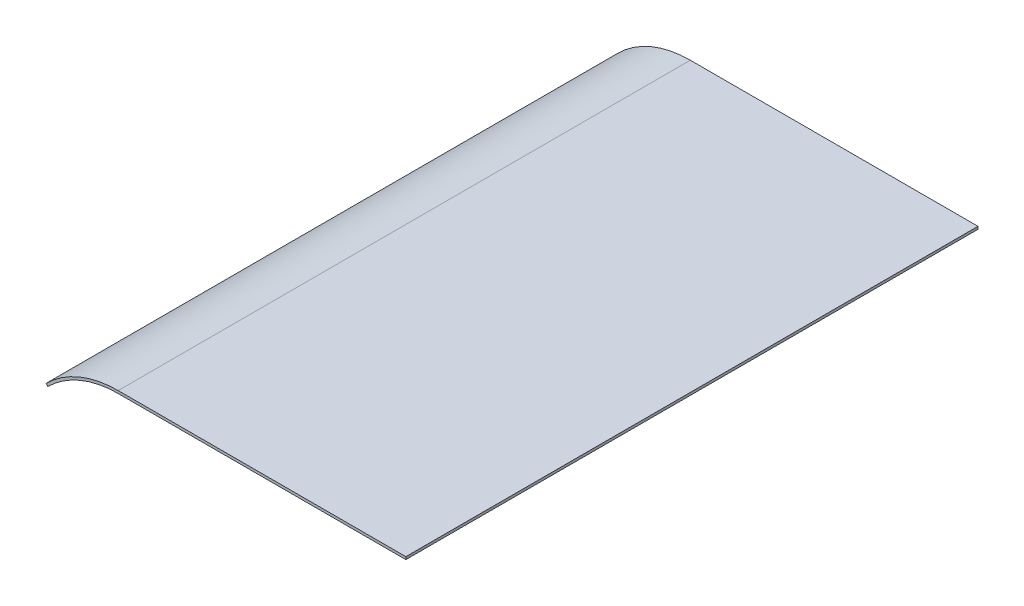
ISO-10303-21;
HEADER;
FILE_DESCRIPTION(('STEP AP214'),'2;1');
FILE_NAME('part.step','',(''),(''),'','','');
FILE_SCHEMA(('AUTOMOTIVE_DESIGN { 1 0 10303 214 1 1 1 1 }'));
ENDSEC;
DATA;
#1=APPLICATION_CONTEXT('core data for automotive mechanical design processes');
#2=APPLICATION_PROTOCOL_DEFINITION('international standard','automotive_design',2000,#1);
#3=PRODUCT_CONTEXT('',#1,'mechanical');
#4=PRODUCT('Part','Part','',(#3));
#5=PRODUCT_RELATED_PRODUCT_CATEGORY('part','',(#4));
#6=PRODUCT_DEFINITION_FORMATION('','',#4);
#7=PRODUCT_DEFINITION_CONTEXT('part definition',#1,'design');
#8=PRODUCT_DEFINITION('design','',#6,#7);
#9=PRODUCT_DEFINITION_SHAPE('','',#8);
#10=(LENGTH_UNIT() NAMED_UNIT(*) SI_UNIT(.MILLI.,.METRE.));
#11=(NAMED_UNIT(*) PLANE_ANGLE_UNIT() SI_UNIT($,.RADIAN.));
#12=(NAMED_UNIT(*) SI_UNIT($,.STERADIAN.) SOLID_ANGLE_UNIT());
#13=UNCERTAINTY_MEASURE_WITH_UNIT(LENGTH_MEASURE(1.E-05),#10,'distance_accuracy_value','');
#14=(GEOMETRIC_REPRESENTATION_CONTEXT(3) GLOBAL_UNCERTAINTY_ASSIGNED_CONTEXT((#13)) GLOBAL_UNIT_ASSIGNED_CONTEXT((#10,
#11,#12)) REPRESENTATION_CONTEXT('',''));
#15=CARTESIAN_POINT('',(0.,0.,0.));
#16=DIRECTION('',(0.,0.,1.));
#17=DIRECTION('',(1.,0.,0.));
#18=AXIS2_PLACEMENT_3D('',#15,#16,#17);
#19=CARTESIAN_POINT('',(-584.19999999997,905.024825288133,165.1));
#20=DIRECTION('',(0.,0.,-1.));
#21=DIRECTION('',(-1.,0.,0.));
#22=AXIS2_PLACEMENT_3D('',#19,#20,#21);
#23=CYLINDRICAL_SURFACE('',#22,58.9051747118665);
#24=CARTESIAN_POINT('',(-584.19999999997,905.024825288133,-165.1));
#25=DIRECTION('',(0.,0.,1.));
#26=DIRECTION('',(1.,0.,0.));
#27=AXIS2_PLACEMENT_3D('',#24,#25,#26);
#28=CIRCLE('',#27,58.9051747118665);
#29=CARTESIAN_POINT('',(-584.19999999997,963.93,-165.1));
#30=VERTEX_POINT('',#29);
#31=CARTESIAN_POINT('',(-625.852248485709,946.677073773873,-165.1));
#32=VERTEX_POINT('',#31);
#33=EDGE_CURVE('E116',#30,#32,#28,.T.);
#34=ORIENTED_EDGE('',*,*,#33,.T.);
#35=DIRECTION('',(0.,0.,-1.));
#36=VECTOR('',#35,1.);
#37=CARTESIAN_POINT('',(-625.852248485709,946.677073773873,165.1));
#38=LINE('',#37,#36);
#39=CARTESIAN_POINT('',(-625.852248485709,946.677073773873,165.1));
#40=VERTEX_POINT('',#39);
#41=EDGE_CURVE('E11',#40,#32,#38,.T.);
#42=ORIENTED_EDGE('',*,*,#41,.F.);
#43=CARTESIAN_POINT('',(-584.19999999997,905.024825288133,165.1));
#44=DIRECTION('',(0.,0.,1.));
#45=DIRECTION('',(1.,0.,0.));
#46=AXIS2_PLACEMENT_3D('',#43,#44,#45);
#47=CIRCLE('',#46,58.9051747118665);
#48=CARTESIAN_POINT('',(-584.19999999997,963.93,165.1));
#49=VERTEX_POINT('',#48);
#50=EDGE_CURVE('E81',#49,#40,#47,.T.);
#51=ORIENTED_EDGE('',*,*,#50,.F.);
#52=DIRECTION('',(0.,0.,-1.));
#53=VECTOR('',#52,1.);
#54=CARTESIAN_POINT('',(-584.19999999997,963.93,165.1));
#55=LINE('',#54,#53);
#56=EDGE_CURVE('E112',#49,#30,#55,.T.);
#57=ORIENTED_EDGE('',*,*,#56,.T.);
#58=EDGE_LOOP('',(#34,#42,#51,#57));
#59=FACE_BOUND('',#58,.T.);
#60=ADVANCED_FACE('F35',(#59),#23,.T.);
#61=CARTESIAN_POINT('',(-624.791588313929,945.616413602093,165.1));
#62=DIRECTION('',(-0.70710678118651,-0.707106781186585,0.));
#63=DIRECTION('',(0.707106781186585,-0.70710678118651,0.));
#64=AXIS2_PLACEMENT_3D('',#61,#62,#63);
#65=PLANE('',#64);
#66=DIRECTION('',(-0.707106781186585,0.70710678118651,0.));
#67=VECTOR('',#66,1.);
#68=CARTESIAN_POINT('',(-624.791588313929,945.616413602093,-165.1));
#69=LINE('',#68,#67);
#70=CARTESIAN_POINT('',(-624.791588313929,945.616413602093,-165.1));
#71=VERTEX_POINT('',#70);
#72=EDGE_CURVE('E119',#71,#32,#69,.T.);
#73=ORIENTED_EDGE('',*,*,#72,.F.);
#74=DIRECTION('',(0.,0.,-1.));
#75=VECTOR('',#74,1.);
#76=CARTESIAN_POINT('',(-624.791588313929,945.616413602093,165.1));
#77=LINE('',#76,#75);
#78=CARTESIAN_POINT('',(-624.791588313929,945.616413602093,165.1));
#79=VERTEX_POINT('',#78);
#80=EDGE_CURVE('E43',#79,#71,#77,.T.);
#81=ORIENTED_EDGE('',*,*,#80,.F.);
#82=DIRECTION('',(-0.707106781186585,0.70710678118651,0.));
#83=VECTOR('',#82,1.);
#84=CARTESIAN_POINT('',(-624.791588313929,945.616413602093,165.1));
#85=LINE('',#84,#83);
#86=EDGE_CURVE('E205',#79,#40,#85,.T.);
#87=ORIENTED_EDGE('',*,*,#86,.T.);
#88=ORIENTED_EDGE('',*,*,#41,.T.);
#89=EDGE_LOOP('',(#73,#81,#87,#88));
#90=FACE_BOUND('',#89,.T.);
#91=ADVANCED_FACE('F137',(#90),#65,.T.);
#92=CARTESIAN_POINT('',(-584.19999999997,905.024825288133,165.1));
#93=DIRECTION('',(0.,0.,-1.));
#94=DIRECTION('',(-1.,0.,0.));
#95=AXIS2_PLACEMENT_3D('',#92,#93,#94);
#96=CYLINDRICAL_SURFACE('',#95,57.4051747118665);
#97=CARTESIAN_POINT('',(-584.19999999997,905.024825288133,-165.1));
#98=DIRECTION('',(0.,0.,1.));
#99=DIRECTION('',(1.,0.,0.));
#100=AXIS2_PLACEMENT_3D('',#97,#98,#99);
#101=CIRCLE('',#100,57.4051747118665);
#102=CARTESIAN_POINT('',(-584.19999999997,962.43,-165.1));
#103=VERTEX_POINT('',#102);
#104=EDGE_CURVE('E122',#103,#71,#101,.T.);
#105=ORIENTED_EDGE('',*,*,#104,.F.);
#106=DIRECTION('',(0.,0.,-1.));
#107=VECTOR('',#106,1.);
#108=CARTESIAN_POINT('',(-584.19999999997,962.43,165.1));
#109=LINE('',#108,#107);
#110=CARTESIAN_POINT('',(-584.19999999997,962.43,165.1));
#111=VERTEX_POINT('',#110);
#112=EDGE_CURVE('E102',#111,#103,#109,.T.);
#113=ORIENTED_EDGE('',*,*,#112,.F.);
#114=CARTESIAN_POINT('',(-584.19999999997,905.024825288133,165.1));
#115=DIRECTION('',(0.,0.,1.));
#116=DIRECTION('',(1.,0.,0.));
#117=AXIS2_PLACEMENT_3D('',#114,#115,#116);
#118=CIRCLE('',#117,57.4051747118665);
#119=EDGE_CURVE('E108',#111,#79,#118,.T.);
#120=ORIENTED_EDGE('',*,*,#119,.T.);
#121=ORIENTED_EDGE('',*,*,#80,.T.);
#122=EDGE_LOOP('',(#105,#113,#120,#121));
#123=FACE_BOUND('',#122,.T.);
#124=ADVANCED_FACE('F134',(#123),#96,.F.);
#125=CARTESIAN_POINT('',(-418.175,962.43,165.1));
#126=DIRECTION('',(0.,-1.,0.));
#127=DIRECTION('',(0.,0.,-1.));
#128=AXIS2_PLACEMENT_3D('',#125,#126,#127);
#129=PLANE('',#128);
#130=DIRECTION('',(1.,0.,0.));
#131=VECTOR('',#130,1.);
#132=CARTESIAN_POINT('',(-418.175,962.43,-165.1));
#133=LINE('',#132,#131);
#134=CARTESIAN_POINT('',(-418.175,962.43,-165.1));
#135=VERTEX_POINT('',#134);
#136=EDGE_CURVE('E97',#135,#103,#133,.F.);
#137=ORIENTED_EDGE('',*,*,#136,.F.);
#138=DIRECTION('',(0.,0.,-1.));
#139=VECTOR('',#138,1.);
#140=CARTESIAN_POINT('',(-418.175,962.43,165.1));
#141=LINE('',#140,#139);
#142=CARTESIAN_POINT('',(-418.175,962.43,165.1));
#143=VERTEX_POINT('',#142);
#144=EDGE_CURVE('E92',#143,#135,#141,.T.);
#145=ORIENTED_EDGE('',*,*,#144,.F.);
#146=DIRECTION('',(1.,0.,0.));
#147=VECTOR('',#146,1.);
#148=CARTESIAN_POINT('',(-418.175,962.43,165.1));
#149=LINE('',#148,#147);
#150=EDGE_CURVE('E95',#143,#111,#149,.F.);
#151=ORIENTED_EDGE('',*,*,#150,.T.);
#152=ORIENTED_EDGE('',*,*,#112,.T.);
#153=EDGE_LOOP('',(#137,#145,#151,#152));
#154=FACE_BOUND('',#153,.T.);
#155=ADVANCED_FACE('F94',(#154),#129,.T.);
#156=CARTESIAN_POINT('',(-418.175,963.93,165.1));
#157=DIRECTION('',(1.,0.,0.));
#158=DIRECTION('',(0.,0.,-1.));
#159=AXIS2_PLACEMENT_3D('',#156,#157,#158);
#160=PLANE('',#159);
#161=DIRECTION('',(0.,-1.,0.));
#162=VECTOR('',#161,1.);
#163=CARTESIAN_POINT('',(-418.175,963.93,-165.1));
#164=LINE('',#163,#162);
#165=CARTESIAN_POINT('',(-418.175,963.93,-165.1));
#166=VERTEX_POINT('',#165);
#167=EDGE_CURVE('E126',#166,#135,#164,.T.);
#168=ORIENTED_EDGE('',*,*,#167,.F.);
#169=DIRECTION('',(0.,0.,-1.));
#170=VECTOR('',#169,1.);
#171=CARTESIAN_POINT('',(-418.175,963.93,165.1));
#172=LINE('',#171,#170);
#173=CARTESIAN_POINT('',(-418.175,963.93,165.1));
#174=VERTEX_POINT('',#173);
#175=EDGE_CURVE('E72',#174,#166,#172,.T.);
#176=ORIENTED_EDGE('',*,*,#175,.F.);
#177=DIRECTION('',(0.,-1.,0.));
#178=VECTOR('',#177,1.);
#179=CARTESIAN_POINT('',(-418.175,963.93,165.1));
#180=LINE('',#179,#178);
#181=EDGE_CURVE('E106',#174,#143,#180,.T.);
#182=ORIENTED_EDGE('',*,*,#181,.T.);
#183=ORIENTED_EDGE('',*,*,#144,.T.);
#184=EDGE_LOOP('',(#168,#176,#182,#183));
#185=FACE_BOUND('',#184,.T.);
#186=ADVANCED_FACE('F110',(#185),#160,.T.);
#187=CARTESIAN_POINT('',(-418.175,963.93,165.1));
#188=DIRECTION('',(0.,-1.,0.));
#189=DIRECTION('',(0.,0.,-1.));
#190=AXIS2_PLACEMENT_3D('',#187,#188,#189);
#191=PLANE('',#190);
#192=DIRECTION('',(-1.,0.,0.));
#193=VECTOR('',#192,1.);
#194=CARTESIAN_POINT('',(-418.175,963.93,-165.1));
#195=LINE('',#194,#193);
#196=EDGE_CURVE('E75',#166,#30,#195,.T.);
#197=ORIENTED_EDGE('',*,*,#196,.T.);
#198=ORIENTED_EDGE('',*,*,#56,.F.);
#199=DIRECTION('',(-1.,0.,0.));
#200=VECTOR('',#199,1.);
#201=CARTESIAN_POINT('',(-418.175,963.93,165.1));
#202=LINE('',#201,#200);
#203=EDGE_CURVE('E51',#174,#49,#202,.T.);
#204=ORIENTED_EDGE('',*,*,#203,.F.);
#205=ORIENTED_EDGE('',*,*,#175,.T.);
#206=EDGE_LOOP('',(#197,#198,#204,#205));
#207=FACE_BOUND('',#206,.T.);
#208=ADVANCED_FACE('F142',(#207),#191,.F.);
#209=CARTESIAN_POINT('',(-584.19999999997,905.024825288133,165.1));
#210=DIRECTION('',(0.,0.,1.));
#211=DIRECTION('',(1.,0.,0.));
#212=AXIS2_PLACEMENT_3D('',#209,#210,#211);
#213=PLANE('',#212);
#214=ORIENTED_EDGE('',*,*,#50,.T.);
#215=ORIENTED_EDGE('',*,*,#86,.F.);
#216=ORIENTED_EDGE('',*,*,#119,.F.);
#217=ORIENTED_EDGE('',*,*,#150,.F.);
#218=ORIENTED_EDGE('',*,*,#181,.F.);
#219=ORIENTED_EDGE('',*,*,#203,.T.);
#220=EDGE_LOOP('',(#214,#215,#216,#217,#218,#219));
#221=FACE_BOUND('',#220,.T.);
#222=ADVANCED_FACE('F105',(#221),#213,.T.);
#223=CARTESIAN_POINT('',(-584.19999999997,905.024825288133,-165.1));
#224=DIRECTION('',(0.,0.,1.));
#225=DIRECTION('',(1.,0.,0.));
#226=AXIS2_PLACEMENT_3D('',#223,#224,#225);
#227=PLANE('',#226);
#228=ORIENTED_EDGE('',*,*,#33,.F.);
#229=ORIENTED_EDGE('',*,*,#196,.F.);
#230=ORIENTED_EDGE('',*,*,#167,.T.);
#231=ORIENTED_EDGE('',*,*,#136,.T.);
#232=ORIENTED_EDGE('',*,*,#104,.T.);
#233=ORIENTED_EDGE('',*,*,#72,.T.);
#234=EDGE_LOOP('',(#228,#229,#230,#231,#232,#233));
#235=FACE_BOUND('',#234,.T.);
#236=ADVANCED_FACE('F140',(#235),#227,.F.);
#237=CLOSED_SHELL('',(#60,#91,#124,#155,#186,#208,#222,#236));
#238=MANIFOLD_SOLID_BREP('B2',#237);
#239=ADVANCED_BREP_SHAPE_REPRESENTATION('',(#18,#238),#14);
#240=SHAPE_DEFINITION_REPRESENTATION(#9,#239);
ENDSEC;
END-ISO-10303-21;
